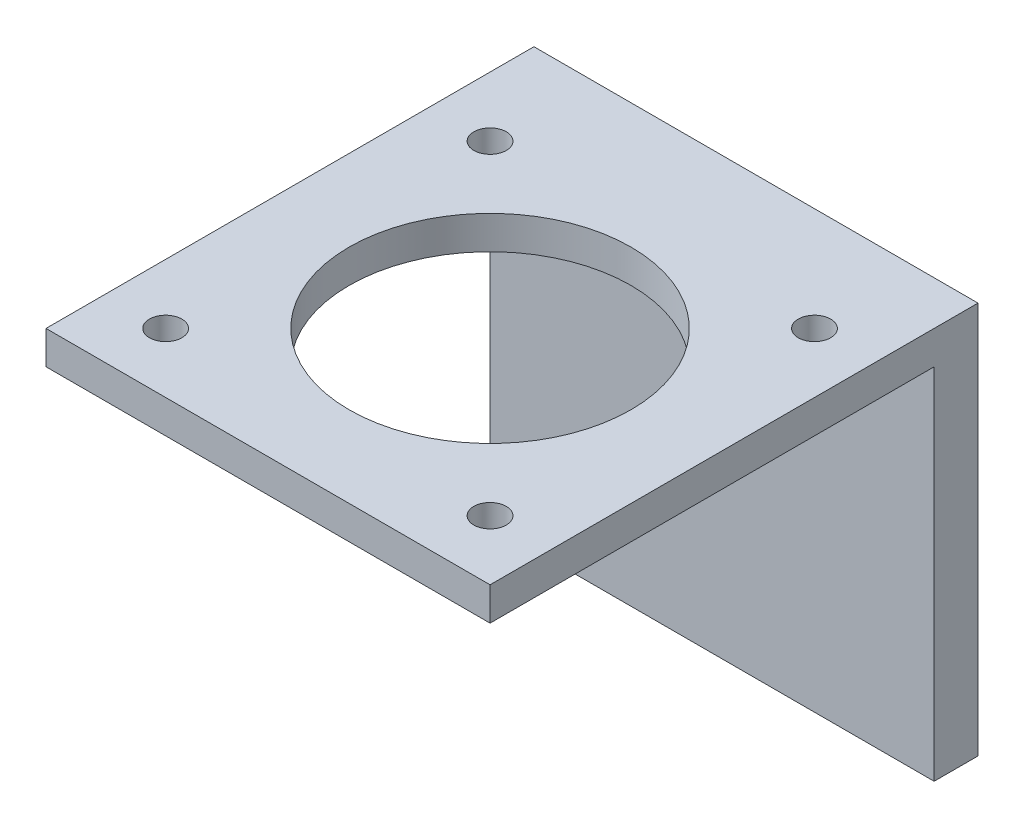
ISO-10303-21;
HEADER;
FILE_DESCRIPTION(('STEP AP214'),'2;1');
FILE_NAME('part.step','',(''),(''),'','','');
FILE_SCHEMA(('AUTOMOTIVE_DESIGN { 1 0 10303 214 1 1 1 1 }'));
ENDSEC;
DATA;
#1=APPLICATION_CONTEXT('core data for automotive mechanical design processes');
#2=APPLICATION_PROTOCOL_DEFINITION('international standard','automotive_design',2000,#1);
#3=PRODUCT_CONTEXT('',#1,'mechanical');
#4=PRODUCT('Part','Part','',(#3));
#5=PRODUCT_RELATED_PRODUCT_CATEGORY('part','',(#4));
#6=PRODUCT_DEFINITION_FORMATION('','',#4);
#7=PRODUCT_DEFINITION_CONTEXT('part definition',#1,'design');
#8=PRODUCT_DEFINITION('design','',#6,#7);
#9=PRODUCT_DEFINITION_SHAPE('','',#8);
#10=(LENGTH_UNIT() NAMED_UNIT(*) SI_UNIT(.MILLI.,.METRE.));
#11=(NAMED_UNIT(*) PLANE_ANGLE_UNIT() SI_UNIT($,.RADIAN.));
#12=(NAMED_UNIT(*) SI_UNIT($,.STERADIAN.) SOLID_ANGLE_UNIT());
#13=UNCERTAINTY_MEASURE_WITH_UNIT(LENGTH_MEASURE(1.E-05),#10,'distance_accuracy_value','');
#14=(GEOMETRIC_REPRESENTATION_CONTEXT(3) GLOBAL_UNCERTAINTY_ASSIGNED_CONTEXT((#13)) GLOBAL_UNIT_ASSIGNED_CONTEXT((#10,
#11,#12)) REPRESENTATION_CONTEXT('',''));
#15=CARTESIAN_POINT('',(0.,0.,0.));
#16=DIRECTION('',(0.,0.,1.));
#17=DIRECTION('',(1.,0.,0.));
#18=AXIS2_PLACEMENT_3D('',#15,#16,#17);
#19=CARTESIAN_POINT('',(0.,3.175,0.));
#20=DIRECTION('',(0.,-1.,0.));
#21=DIRECTION('',(0.,0.,-1.));
#22=AXIS2_PLACEMENT_3D('',#19,#20,#21);
#23=PLANE('',#22);
#24=DIRECTION('',(0.,0.,-1.));
#25=VECTOR('',#24,1.);
#26=CARTESIAN_POINT('',(21.209,3.175,21.209));
#27=LINE('',#26,#25);
#28=CARTESIAN_POINT('',(21.209,3.175,21.209));
#29=VERTEX_POINT('',#28);
#30=CARTESIAN_POINT('',(21.209,3.175,-25.4));
#31=VERTEX_POINT('',#30);
#32=EDGE_CURVE('E82',#29,#31,#27,.T.);
#33=ORIENTED_EDGE('',*,*,#32,.T.);
#34=DIRECTION('',(-1.,0.,0.));
#35=VECTOR('',#34,1.);
#36=CARTESIAN_POINT('',(-21.209,3.175,-25.4));
#37=LINE('',#36,#35);
#38=CARTESIAN_POINT('',(-21.209,3.175,-25.4));
#39=VERTEX_POINT('',#38);
#40=EDGE_CURVE('E165',#31,#39,#37,.T.);
#41=ORIENTED_EDGE('',*,*,#40,.T.);
#42=DIRECTION('',(0.,0.,1.));
#43=VECTOR('',#42,1.);
#44=CARTESIAN_POINT('',(-21.209,3.175,21.209));
#45=LINE('',#44,#43);
#46=CARTESIAN_POINT('',(-21.209,3.175,21.209));
#47=VERTEX_POINT('',#46);
#48=EDGE_CURVE('E110',#39,#47,#45,.T.);
#49=ORIENTED_EDGE('',*,*,#48,.T.);
#50=DIRECTION('',(1.,0.,0.));
#51=VECTOR('',#50,1.);
#52=CARTESIAN_POINT('',(-21.209,3.175,21.209));
#53=LINE('',#52,#51);
#54=EDGE_CURVE('E57',#47,#29,#53,.T.);
#55=ORIENTED_EDGE('',*,*,#54,.T.);
#56=EDGE_LOOP('',(#33,#41,#49,#55));
#57=FACE_BOUND('',#56,.T.);
#58=CARTESIAN_POINT('',(15.494,3.175,-15.494));
#59=DIRECTION('',(0.,1.,0.));
#60=DIRECTION('',(0.,0.,1.));
#61=AXIS2_PLACEMENT_3D('',#58,#59,#60);
#62=CIRCLE('',#61,1.5494);
#63=CARTESIAN_POINT('',(15.494,3.175,-13.9446));
#64=VERTEX_POINT('',#63);
#65=EDGE_CURVE('E96',#64,#64,#62,.T.);
#66=ORIENTED_EDGE('',*,*,#65,.F.);
#67=EDGE_LOOP('',(#66));
#68=FACE_BOUND('',#67,.T.);
#69=CARTESIAN_POINT('',(-15.494,3.175,-15.494));
#70=DIRECTION('',(0.,1.,0.));
#71=DIRECTION('',(0.,0.,-1.));
#72=AXIS2_PLACEMENT_3D('',#69,#70,#71);
#73=CIRCLE('',#72,1.5494);
#74=CARTESIAN_POINT('',(-15.494,3.175,-17.0434));
#75=VERTEX_POINT('',#74);
#76=EDGE_CURVE('E118',#75,#75,#73,.T.);
#77=ORIENTED_EDGE('',*,*,#76,.F.);
#78=EDGE_LOOP('',(#77));
#79=FACE_BOUND('',#78,.T.);
#80=CARTESIAN_POINT('',(15.494,3.175,15.494));
#81=DIRECTION('',(0.,1.,0.));
#82=DIRECTION('',(0.,0.,-1.));
#83=AXIS2_PLACEMENT_3D('',#80,#81,#82);
#84=CIRCLE('',#83,1.5494);
#85=CARTESIAN_POINT('',(15.494,3.175,13.9446));
#86=VERTEX_POINT('',#85);
#87=EDGE_CURVE('E124',#86,#86,#84,.T.);
#88=ORIENTED_EDGE('',*,*,#87,.F.);
#89=EDGE_LOOP('',(#88));
#90=FACE_BOUND('',#89,.T.);
#91=CARTESIAN_POINT('',(-15.494,3.175,15.494));
#92=DIRECTION('',(0.,1.,0.));
#93=DIRECTION('',(0.,0.,1.));
#94=AXIS2_PLACEMENT_3D('',#91,#92,#93);
#95=CIRCLE('',#94,1.5494);
#96=CARTESIAN_POINT('',(-15.494,3.175,17.0434));
#97=VERTEX_POINT('',#96);
#98=EDGE_CURVE('E132',#97,#97,#95,.T.);
#99=ORIENTED_EDGE('',*,*,#98,.F.);
#100=EDGE_LOOP('',(#99));
#101=FACE_BOUND('',#100,.T.);
#102=CARTESIAN_POINT('',(0.,3.175,0.));
#103=DIRECTION('',(0.,1.,0.));
#104=DIRECTION('',(0.,0.,1.));
#105=AXIS2_PLACEMENT_3D('',#102,#103,#104);
#106=CIRCLE('',#105,13.462);
#107=CARTESIAN_POINT('',(0.,3.175,13.462));
#108=VERTEX_POINT('',#107);
#109=EDGE_CURVE('E140',#108,#108,#106,.T.);
#110=ORIENTED_EDGE('',*,*,#109,.F.);
#111=EDGE_LOOP('',(#110));
#112=FACE_BOUND('',#111,.T.);
#113=ADVANCED_FACE('F39',(#57,#68,#79,#90,#101,#112),#23,.F.);
#114=CARTESIAN_POINT('',(0.,0.,0.));
#115=DIRECTION('',(0.,-1.,0.));
#116=DIRECTION('',(0.,0.,-1.));
#117=AXIS2_PLACEMENT_3D('',#114,#115,#116);
#118=PLANE('',#117);
#119=CARTESIAN_POINT('',(-15.494,0.,15.494));
#120=DIRECTION('',(0.,1.,0.));
#121=DIRECTION('',(0.,0.,1.));
#122=AXIS2_PLACEMENT_3D('',#119,#120,#121);
#123=CIRCLE('',#122,1.5494);
#124=CARTESIAN_POINT('',(-15.494,0.,17.0434));
#125=VERTEX_POINT('',#124);
#126=EDGE_CURVE('E136',#125,#125,#123,.T.);
#127=ORIENTED_EDGE('',*,*,#126,.T.);
#128=EDGE_LOOP('',(#127));
#129=FACE_BOUND('',#128,.T.);
#130=CARTESIAN_POINT('',(-15.494,0.,-15.494));
#131=DIRECTION('',(0.,1.,0.));
#132=DIRECTION('',(0.,0.,-1.));
#133=AXIS2_PLACEMENT_3D('',#130,#131,#132);
#134=CIRCLE('',#133,1.5494);
#135=CARTESIAN_POINT('',(-15.494,0.,-17.0434));
#136=VERTEX_POINT('',#135);
#137=EDGE_CURVE('E120',#136,#136,#134,.T.);
#138=ORIENTED_EDGE('',*,*,#137,.T.);
#139=EDGE_LOOP('',(#138));
#140=FACE_BOUND('',#139,.T.);
#141=DIRECTION('',(0.,0.,-1.));
#142=VECTOR('',#141,1.);
#143=CARTESIAN_POINT('',(21.209,0.,21.209));
#144=LINE('',#143,#142);
#145=CARTESIAN_POINT('',(21.209,0.,21.209));
#146=VERTEX_POINT('',#145);
#147=CARTESIAN_POINT('',(21.209,0.,-21.209));
#148=VERTEX_POINT('',#147);
#149=EDGE_CURVE('E87',#146,#148,#144,.T.);
#150=ORIENTED_EDGE('',*,*,#149,.F.);
#151=DIRECTION('',(1.,0.,0.));
#152=VECTOR('',#151,1.);
#153=CARTESIAN_POINT('',(-21.209,0.,21.209));
#154=LINE('',#153,#152);
#155=CARTESIAN_POINT('',(-21.209,0.,21.209));
#156=VERTEX_POINT('',#155);
#157=EDGE_CURVE('E75',#156,#146,#154,.T.);
#158=ORIENTED_EDGE('',*,*,#157,.F.);
#159=DIRECTION('',(0.,0.,1.));
#160=VECTOR('',#159,1.);
#161=CARTESIAN_POINT('',(-21.209,0.,21.209));
#162=LINE('',#161,#160);
#163=CARTESIAN_POINT('',(-21.209,0.,-21.209));
#164=VERTEX_POINT('',#163);
#165=EDGE_CURVE('E71',#164,#156,#162,.T.);
#166=ORIENTED_EDGE('',*,*,#165,.F.);
#167=DIRECTION('',(-1.,0.,0.));
#168=VECTOR('',#167,1.);
#169=CARTESIAN_POINT('',(-21.209,0.,-21.209));
#170=LINE('',#169,#168);
#171=EDGE_CURVE('E94',#148,#164,#170,.T.);
#172=ORIENTED_EDGE('',*,*,#171,.F.);
#173=EDGE_LOOP('',(#150,#158,#166,#172));
#174=FACE_BOUND('',#173,.T.);
#175=CARTESIAN_POINT('',(15.494,0.,-15.494));
#176=DIRECTION('',(0.,1.,0.));
#177=DIRECTION('',(0.,0.,1.));
#178=AXIS2_PLACEMENT_3D('',#175,#176,#177);
#179=CIRCLE('',#178,1.5494);
#180=CARTESIAN_POINT('',(15.494,0.,-13.9446));
#181=VERTEX_POINT('',#180);
#182=EDGE_CURVE('E102',#181,#181,#179,.T.);
#183=ORIENTED_EDGE('',*,*,#182,.T.);
#184=EDGE_LOOP('',(#183));
#185=FACE_BOUND('',#184,.T.);
#186=CARTESIAN_POINT('',(15.494,0.,15.494));
#187=DIRECTION('',(0.,1.,0.));
#188=DIRECTION('',(0.,0.,-1.));
#189=AXIS2_PLACEMENT_3D('',#186,#187,#188);
#190=CIRCLE('',#189,1.5494);
#191=CARTESIAN_POINT('',(15.494,0.,13.9446));
#192=VERTEX_POINT('',#191);
#193=EDGE_CURVE('E128',#192,#192,#190,.T.);
#194=ORIENTED_EDGE('',*,*,#193,.T.);
#195=EDGE_LOOP('',(#194));
#196=FACE_BOUND('',#195,.T.);
#197=CARTESIAN_POINT('',(0.,0.,0.));
#198=DIRECTION('',(0.,1.,0.));
#199=DIRECTION('',(0.,0.,1.));
#200=AXIS2_PLACEMENT_3D('',#197,#198,#199);
#201=CIRCLE('',#200,13.462);
#202=CARTESIAN_POINT('',(0.,0.,13.462));
#203=VERTEX_POINT('',#202);
#204=EDGE_CURVE('E144',#203,#203,#201,.T.);
#205=ORIENTED_EDGE('',*,*,#204,.T.);
#206=EDGE_LOOP('',(#205));
#207=FACE_BOUND('',#206,.T.);
#208=ADVANCED_FACE('F91',(#129,#140,#174,#185,#196,#207),#118,.T.);
#209=CARTESIAN_POINT('',(21.209,3.175,21.209));
#210=DIRECTION('',(-1.,0.,0.));
#211=DIRECTION('',(0.,0.,1.));
#212=AXIS2_PLACEMENT_3D('',#209,#210,#211);
#213=PLANE('',#212);
#214=ORIENTED_EDGE('',*,*,#149,.T.);
#215=DIRECTION('',(0.,1.,0.));
#216=VECTOR('',#215,1.);
#217=CARTESIAN_POINT('',(21.209,-34.29,-21.209));
#218=LINE('',#217,#216);
#219=CARTESIAN_POINT('',(21.209,-34.29,-21.209));
#220=VERTEX_POINT('',#219);
#221=EDGE_CURVE('E152',#220,#148,#218,.T.);
#222=ORIENTED_EDGE('',*,*,#221,.F.);
#223=DIRECTION('',(0.,0.,-1.));
#224=VECTOR('',#223,1.);
#225=CARTESIAN_POINT('',(21.209,-34.29,-21.209));
#226=LINE('',#225,#224);
#227=CARTESIAN_POINT('',(21.209,-34.29,-25.4));
#228=VERTEX_POINT('',#227);
#229=EDGE_CURVE('E176',#220,#228,#226,.T.);
#230=ORIENTED_EDGE('',*,*,#229,.T.);
#231=DIRECTION('',(0.,1.,0.));
#232=VECTOR('',#231,1.);
#233=CARTESIAN_POINT('',(21.209,-34.29,-25.4));
#234=LINE('',#233,#232);
#235=EDGE_CURVE('E155',#228,#31,#234,.T.);
#236=ORIENTED_EDGE('',*,*,#235,.T.);
#237=ORIENTED_EDGE('',*,*,#32,.F.);
#238=DIRECTION('',(0.,-1.,0.));
#239=VECTOR('',#238,1.);
#240=CARTESIAN_POINT('',(21.209,3.175,21.209));
#241=LINE('',#240,#239);
#242=EDGE_CURVE('E49',#29,#146,#241,.T.);
#243=ORIENTED_EDGE('',*,*,#242,.T.);
#244=EDGE_LOOP('',(#214,#222,#230,#236,#237,#243));
#245=FACE_BOUND('',#244,.T.);
#246=ADVANCED_FACE('F41',(#245),#213,.F.);
#247=CARTESIAN_POINT('',(-21.209,3.175,21.209));
#248=DIRECTION('',(1.,0.,0.));
#249=DIRECTION('',(0.,0.,-1.));
#250=AXIS2_PLACEMENT_3D('',#247,#248,#249);
#251=PLANE('',#250);
#252=ORIENTED_EDGE('',*,*,#165,.T.);
#253=DIRECTION('',(0.,-1.,0.));
#254=VECTOR('',#253,1.);
#255=CARTESIAN_POINT('',(-21.209,3.175,21.209));
#256=LINE('',#255,#254);
#257=EDGE_CURVE('E11',#47,#156,#256,.T.);
#258=ORIENTED_EDGE('',*,*,#257,.F.);
#259=ORIENTED_EDGE('',*,*,#48,.F.);
#260=DIRECTION('',(0.,1.,0.));
#261=VECTOR('',#260,1.);
#262=CARTESIAN_POINT('',(-21.209,-34.29,-25.4));
#263=LINE('',#262,#261);
#264=CARTESIAN_POINT('',(-21.209,-34.29,-25.4));
#265=VERTEX_POINT('',#264);
#266=EDGE_CURVE('E159',#265,#39,#263,.T.);
#267=ORIENTED_EDGE('',*,*,#266,.F.);
#268=DIRECTION('',(0.,0.,1.));
#269=VECTOR('',#268,1.);
#270=CARTESIAN_POINT('',(-21.209,-34.29,-21.209));
#271=LINE('',#270,#269);
#272=CARTESIAN_POINT('',(-21.209,-34.29,-21.209));
#273=VERTEX_POINT('',#272);
#274=EDGE_CURVE('E156',#265,#273,#271,.T.);
#275=ORIENTED_EDGE('',*,*,#274,.T.);
#276=DIRECTION('',(0.,1.,0.));
#277=VECTOR('',#276,1.);
#278=CARTESIAN_POINT('',(-21.209,-34.29,-21.209));
#279=LINE('',#278,#277);
#280=EDGE_CURVE('E148',#273,#164,#279,.T.);
#281=ORIENTED_EDGE('',*,*,#280,.T.);
#282=EDGE_LOOP('',(#252,#258,#259,#267,#275,#281));
#283=FACE_BOUND('',#282,.T.);
#284=ADVANCED_FACE('F199',(#283),#251,.F.);
#285=CARTESIAN_POINT('',(-21.209,3.175,21.209));
#286=DIRECTION('',(0.,0.,-1.));
#287=DIRECTION('',(-1.,0.,0.));
#288=AXIS2_PLACEMENT_3D('',#285,#286,#287);
#289=PLANE('',#288);
#290=ORIENTED_EDGE('',*,*,#157,.T.);
#291=ORIENTED_EDGE('',*,*,#242,.F.);
#292=ORIENTED_EDGE('',*,*,#54,.F.);
#293=ORIENTED_EDGE('',*,*,#257,.T.);
#294=EDGE_LOOP('',(#290,#291,#292,#293));
#295=FACE_BOUND('',#294,.T.);
#296=ADVANCED_FACE('F77',(#295),#289,.F.);
#297=CARTESIAN_POINT('',(15.494,3.175,-15.494));
#298=DIRECTION('',(0.,-1.,0.));
#299=DIRECTION('',(0.,0.,-1.));
#300=AXIS2_PLACEMENT_3D('',#297,#298,#299);
#301=CYLINDRICAL_SURFACE('',#300,1.5494);
#302=ORIENTED_EDGE('',*,*,#65,.T.);
#303=EDGE_LOOP('',(#302));
#304=FACE_BOUND('',#303,.T.);
#305=ORIENTED_EDGE('',*,*,#182,.F.);
#306=EDGE_LOOP('',(#305));
#307=FACE_BOUND('',#306,.T.);
#308=ADVANCED_FACE('F239',(#304,#307),#301,.F.);
#309=CARTESIAN_POINT('',(-15.494,3.175,-15.494));
#310=DIRECTION('',(0.,-1.,0.));
#311=DIRECTION('',(0.,0.,-1.));
#312=AXIS2_PLACEMENT_3D('',#309,#310,#311);
#313=CYLINDRICAL_SURFACE('',#312,1.5494);
#314=ORIENTED_EDGE('',*,*,#76,.T.);
#315=EDGE_LOOP('',(#314));
#316=FACE_BOUND('',#315,.T.);
#317=ORIENTED_EDGE('',*,*,#137,.F.);
#318=EDGE_LOOP('',(#317));
#319=FACE_BOUND('',#318,.T.);
#320=ADVANCED_FACE('F256',(#316,#319),#313,.F.);
#321=CARTESIAN_POINT('',(15.494,3.175,15.494));
#322=DIRECTION('',(0.,-1.,0.));
#323=DIRECTION('',(0.,0.,-1.));
#324=AXIS2_PLACEMENT_3D('',#321,#322,#323);
#325=CYLINDRICAL_SURFACE('',#324,1.5494);
#326=ORIENTED_EDGE('',*,*,#87,.T.);
#327=EDGE_LOOP('',(#326));
#328=FACE_BOUND('',#327,.T.);
#329=ORIENTED_EDGE('',*,*,#193,.F.);
#330=EDGE_LOOP('',(#329));
#331=FACE_BOUND('',#330,.T.);
#332=ADVANCED_FACE('F263',(#328,#331),#325,.F.);
#333=CARTESIAN_POINT('',(-15.494,3.175,15.494));
#334=DIRECTION('',(0.,-1.,0.));
#335=DIRECTION('',(0.,0.,-1.));
#336=AXIS2_PLACEMENT_3D('',#333,#334,#335);
#337=CYLINDRICAL_SURFACE('',#336,1.5494);
#338=ORIENTED_EDGE('',*,*,#98,.T.);
#339=EDGE_LOOP('',(#338));
#340=FACE_BOUND('',#339,.T.);
#341=ORIENTED_EDGE('',*,*,#126,.F.);
#342=EDGE_LOOP('',(#341));
#343=FACE_BOUND('',#342,.T.);
#344=ADVANCED_FACE('F225',(#340,#343),#337,.F.);
#345=CARTESIAN_POINT('',(0.,3.175,0.));
#346=DIRECTION('',(0.,-1.,0.));
#347=DIRECTION('',(0.,0.,-1.));
#348=AXIS2_PLACEMENT_3D('',#345,#346,#347);
#349=CYLINDRICAL_SURFACE('',#348,13.462);
#350=ORIENTED_EDGE('',*,*,#109,.T.);
#351=EDGE_LOOP('',(#350));
#352=FACE_BOUND('',#351,.T.);
#353=ORIENTED_EDGE('',*,*,#204,.F.);
#354=EDGE_LOOP('',(#353));
#355=FACE_BOUND('',#354,.T.);
#356=ADVANCED_FACE('F222',(#352,#355),#349,.F.);
#357=CARTESIAN_POINT('',(-21.209,-34.29,-21.209));
#358=DIRECTION('',(0.,0.,1.));
#359=DIRECTION('',(1.,0.,0.));
#360=AXIS2_PLACEMENT_3D('',#357,#358,#359);
#361=PLANE('',#360);
#362=ORIENTED_EDGE('',*,*,#221,.T.);
#363=ORIENTED_EDGE('',*,*,#171,.T.);
#364=ORIENTED_EDGE('',*,*,#280,.F.);
#365=DIRECTION('',(1.,0.,0.));
#366=VECTOR('',#365,1.);
#367=CARTESIAN_POINT('',(-21.209,-34.29,-21.209));
#368=LINE('',#367,#366);
#369=EDGE_CURVE('E168',#273,#220,#368,.T.);
#370=ORIENTED_EDGE('',*,*,#369,.T.);
#371=EDGE_LOOP('',(#362,#363,#364,#370));
#372=FACE_BOUND('',#371,.T.);
#373=ADVANCED_FACE('F186',(#372),#361,.T.);
#374=CARTESIAN_POINT('',(-21.209,-34.29,-25.4));
#375=DIRECTION('',(0.,0.,-1.));
#376=DIRECTION('',(-1.,0.,0.));
#377=AXIS2_PLACEMENT_3D('',#374,#375,#376);
#378=PLANE('',#377);
#379=ORIENTED_EDGE('',*,*,#40,.F.);
#380=ORIENTED_EDGE('',*,*,#235,.F.);
#381=DIRECTION('',(-1.,0.,0.));
#382=VECTOR('',#381,1.);
#383=CARTESIAN_POINT('',(-21.209,-34.29,-25.4));
#384=LINE('',#383,#382);
#385=EDGE_CURVE('E172',#228,#265,#384,.T.);
#386=ORIENTED_EDGE('',*,*,#385,.T.);
#387=ORIENTED_EDGE('',*,*,#266,.T.);
#388=EDGE_LOOP('',(#379,#380,#386,#387));
#389=FACE_BOUND('',#388,.T.);
#390=ADVANCED_FACE('F204',(#389),#378,.T.);
#391=CARTESIAN_POINT('',(0.,-34.29,0.));
#392=DIRECTION('',(0.,1.,0.));
#393=DIRECTION('',(0.,0.,1.));
#394=AXIS2_PLACEMENT_3D('',#391,#392,#393);
#395=PLANE('',#394);
#396=ORIENTED_EDGE('',*,*,#369,.F.);
#397=ORIENTED_EDGE('',*,*,#274,.F.);
#398=ORIENTED_EDGE('',*,*,#385,.F.);
#399=ORIENTED_EDGE('',*,*,#229,.F.);
#400=EDGE_LOOP('',(#396,#397,#398,#399));
#401=FACE_BOUND('',#400,.T.);
#402=ADVANCED_FACE('F194',(#401),#395,.F.);
#403=CLOSED_SHELL('',(#113,#208,#246,#284,#296,#308,#320,#332,#344,#356,#373,#390,#402));
#404=MANIFOLD_SOLID_BREP('B2',#403);
#405=ADVANCED_BREP_SHAPE_REPRESENTATION('',(#18,#404),#14);
#406=SHAPE_DEFINITION_REPRESENTATION(#9,#405);
ENDSEC;
END-ISO-10303-21;
